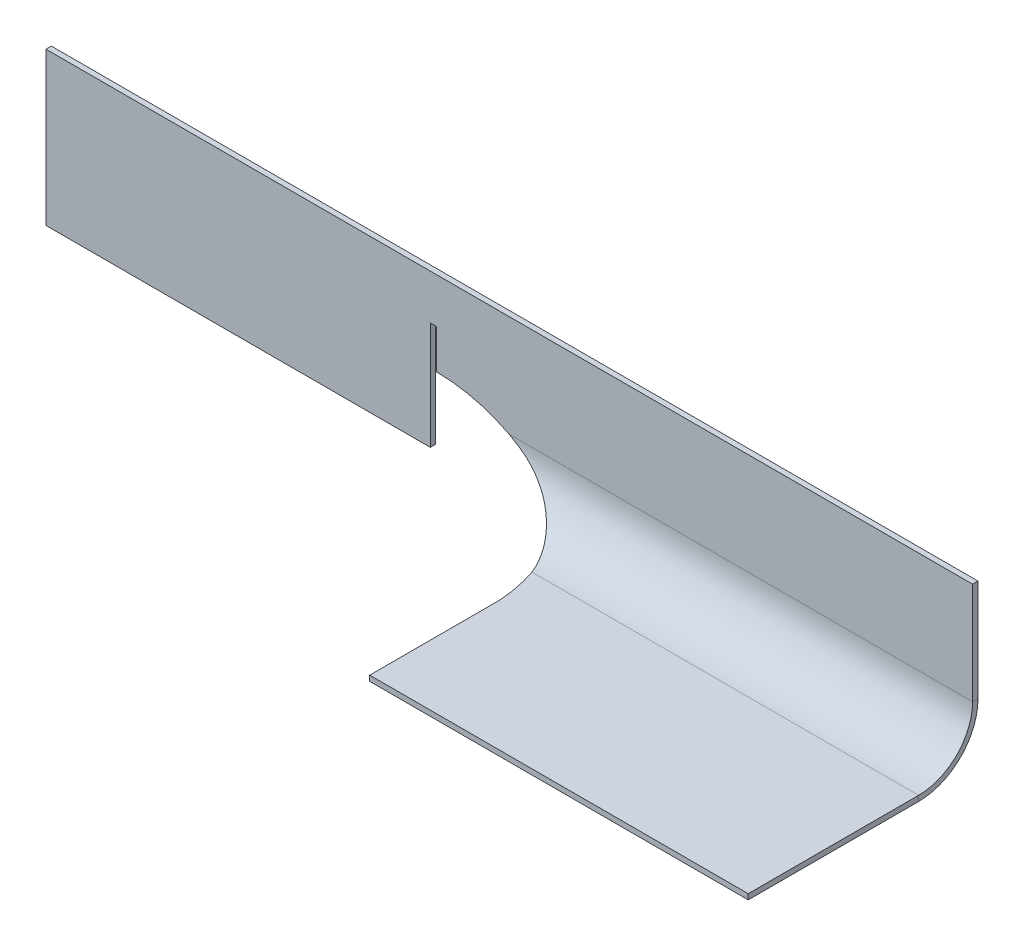
ISO-10303-21;
HEADER;
FILE_DESCRIPTION(('STEP AP214'),'2;1');
FILE_NAME('part.step','',(''),(''),'','','');
FILE_SCHEMA(('AUTOMOTIVE_DESIGN { 1 0 10303 214 1 1 1 1 }'));
ENDSEC;
DATA;
#1=APPLICATION_CONTEXT('core data for automotive mechanical design processes');
#2=APPLICATION_PROTOCOL_DEFINITION('international standard','automotive_design',2000,#1);
#3=PRODUCT_CONTEXT('',#1,'mechanical');
#4=PRODUCT('Part','Part','',(#3));
#5=PRODUCT_RELATED_PRODUCT_CATEGORY('part','',(#4));
#6=PRODUCT_DEFINITION_FORMATION('','',#4);
#7=PRODUCT_DEFINITION_CONTEXT('part definition',#1,'design');
#8=PRODUCT_DEFINITION('design','',#6,#7);
#9=PRODUCT_DEFINITION_SHAPE('','',#8);
#10=(LENGTH_UNIT() NAMED_UNIT(*) SI_UNIT(.MILLI.,.METRE.));
#11=(NAMED_UNIT(*) PLANE_ANGLE_UNIT() SI_UNIT($,.RADIAN.));
#12=(NAMED_UNIT(*) SI_UNIT($,.STERADIAN.) SOLID_ANGLE_UNIT());
#13=UNCERTAINTY_MEASURE_WITH_UNIT(LENGTH_MEASURE(1.E-05),#10,'distance_accuracy_value','');
#14=(GEOMETRIC_REPRESENTATION_CONTEXT(3) GLOBAL_UNCERTAINTY_ASSIGNED_CONTEXT((#13)) GLOBAL_UNIT_ASSIGNED_CONTEXT((#10,
#11,#12)) REPRESENTATION_CONTEXT('',''));
#15=CARTESIAN_POINT('',(0.,0.,0.));
#16=DIRECTION('',(0.,0.,1.));
#17=DIRECTION('',(1.,0.,0.));
#18=AXIS2_PLACEMENT_3D('',#15,#16,#17);
#19=CARTESIAN_POINT('',(72.3649053756987,-28.8652179905853,21.4667213985971));
#20=DIRECTION('',(0.,-1.,0.));
#21=DIRECTION('',(-1.,0.,0.));
#22=AXIS2_PLACEMENT_3D('',#19,#20,#21);
#23=CYLINDRICAL_SURFACE('',#22,29.2213818747976);
#24=CARTESIAN_POINT('',(72.3649053756987,-28.8652179905853,21.4667213985971));
#25=DIRECTION('',(0.,-1.,0.));
#26=DIRECTION('',(-1.,0.,0.));
#27=AXIS2_PLACEMENT_3D('',#24,#25,#26);
#28=CIRCLE('',#27,29.2213818747976);
#29=CARTESIAN_POINT('',(100.010345228125,-28.8652179905853,12.));
#30=VERTEX_POINT('',#29);
#31=CARTESIAN_POINT('',(101.514777341765,-28.8652179905853,19.4236543329572));
#32=VERTEX_POINT('',#31);
#33=EDGE_CURVE('E378',#30,#32,#28,.T.);
#34=ORIENTED_EDGE('',*,*,#33,.F.);
#35=CARTESIAN_POINT('',(100.010345228125,-29.8652179905853,12.));
#36=CARTESIAN_POINT('',(100.010345228125,-28.8652179905853,12.));
#37=B_SPLINE_CURVE_WITH_KNOTS('',1,(#35,#36),.UNSPECIFIED.,.F.,.F.,(2,2),(0.,1.),.UNSPECIFIED.);
#38=CARTESIAN_POINT('',(100.010345228125,-29.8652179905853,12.));
#39=VERTEX_POINT('',#38);
#40=EDGE_CURVE('E12',#30,#39,#37,.F.);
#41=ORIENTED_EDGE('',*,*,#40,.T.);
#42=CARTESIAN_POINT('',(72.3649053756987,-29.8652179905853,21.4667213985971));
#43=DIRECTION('',(0.,-1.,0.));
#44=DIRECTION('',(-1.,0.,0.));
#45=AXIS2_PLACEMENT_3D('',#42,#43,#44);
#46=CIRCLE('',#45,29.2213818747976);
#47=CARTESIAN_POINT('',(101.514777341765,-29.8652179905853,19.4236543329572));
#48=VERTEX_POINT('',#47);
#49=EDGE_CURVE('E65',#39,#48,#46,.T.);
#50=ORIENTED_EDGE('',*,*,#49,.T.);
#51=DIRECTION('',(0.,1.,0.));
#52=VECTOR('',#51,1.);
#53=CARTESIAN_POINT('',(101.514777341765,-28.8652179905853,19.4236543329572));
#54=LINE('',#53,#52);
#55=EDGE_CURVE('E178',#48,#32,#54,.T.);
#56=ORIENTED_EDGE('',*,*,#55,.T.);
#57=EDGE_LOOP('',(#34,#41,#50,#56));
#58=FACE_BOUND('',#57,.T.);
#59=ADVANCED_FACE('F49',(#58),#23,.F.);
#60=CARTESIAN_POINT('',(171.620662180867,-28.8652179905854,-23.3585794219317));
#61=DIRECTION('',(-1.,0.,0.));
#62=DIRECTION('',(0.,0.,-1.));
#63=AXIS2_PLACEMENT_3D('',#60,#61,#62);
#64=PLANE('',#63);
#65=DIRECTION('',(0.,0.,-1.));
#66=VECTOR('',#65,1.);
#67=CARTESIAN_POINT('',(171.620662180867,-29.8652179905853,21.4667213985971));
#68=LINE('',#67,#66);
#69=CARTESIAN_POINT('',(171.620662180867,-29.8652179905852,43.5586281703939));
#70=VERTEX_POINT('',#69);
#71=CARTESIAN_POINT('',(171.620662180867,-29.8652179905853,12.));
#72=VERTEX_POINT('',#71);
#73=EDGE_CURVE('E72',#70,#72,#68,.T.);
#74=ORIENTED_EDGE('',*,*,#73,.T.);
#75=DIRECTION('',(0.,1.,0.));
#76=VECTOR('',#75,1.);
#77=CARTESIAN_POINT('',(171.620662180867,-28.8652179905856,12.));
#78=LINE('',#77,#76);
#79=CARTESIAN_POINT('',(171.620662180867,-28.8652179905853,12.));
#80=VERTEX_POINT('',#79);
#81=EDGE_CURVE('E149',#72,#80,#78,.T.);
#82=ORIENTED_EDGE('',*,*,#81,.T.);
#83=DIRECTION('',(0.,0.,-1.));
#84=VECTOR('',#83,1.);
#85=CARTESIAN_POINT('',(171.620662180867,-28.8652179905854,-23.3585794219317));
#86=LINE('',#85,#84);
#87=CARTESIAN_POINT('',(171.620662180867,-28.8652179905852,43.5586281703939));
#88=VERTEX_POINT('',#87);
#89=EDGE_CURVE('E152',#88,#80,#86,.T.);
#90=ORIENTED_EDGE('',*,*,#89,.F.);
#91=DIRECTION('',(0.,1.,0.));
#92=VECTOR('',#91,1.);
#93=CARTESIAN_POINT('',(171.620662180867,-28.8652179905852,43.5586281703939));
#94=LINE('',#93,#92);
#95=EDGE_CURVE('E167',#70,#88,#94,.T.);
#96=ORIENTED_EDGE('',*,*,#95,.F.);
#97=EDGE_LOOP('',(#74,#82,#90,#96));
#98=FACE_BOUND('',#97,.T.);
#99=ADVANCED_FACE('F151',(#98),#64,.F.);
#100=CARTESIAN_POINT('',(72.3649053756987,-29.8652179905853,21.4667213985971));
#101=DIRECTION('',(0.,-1.,0.));
#102=DIRECTION('',(-1.,0.,0.));
#103=AXIS2_PLACEMENT_3D('',#100,#101,#102);
#104=PLANE('',#103);
#105=ORIENTED_EDGE('',*,*,#49,.F.);
#106=DIRECTION('',(1.,0.,0.));
#107=VECTOR('',#106,1.);
#108=CARTESIAN_POINT('',(72.3649053756987,-29.8652179905853,12.));
#109=LINE('',#108,#107);
#110=EDGE_CURVE('E58',#39,#72,#109,.T.);
#111=ORIENTED_EDGE('',*,*,#110,.T.);
#112=ORIENTED_EDGE('',*,*,#73,.F.);
#113=DIRECTION('',(-1.,0.,0.));
#114=VECTOR('',#113,1.);
#115=CARTESIAN_POINT('',(72.3649053756987,-29.8652179905852,43.558628170394));
#116=LINE('',#115,#114);
#117=CARTESIAN_POINT('',(101.514777341765,-29.8652179905852,43.558628170394));
#118=VERTEX_POINT('',#117);
#119=EDGE_CURVE('E394',#118,#70,#116,.F.);
#120=ORIENTED_EDGE('',*,*,#119,.F.);
#121=DIRECTION('',(0.,0.,-1.));
#122=VECTOR('',#121,1.);
#123=CARTESIAN_POINT('',(101.514777341765,-29.8652179905853,21.4667213985971));
#124=LINE('',#123,#122);
#125=EDGE_CURVE('E392',#48,#118,#124,.F.);
#126=ORIENTED_EDGE('',*,*,#125,.F.);
#127=EDGE_LOOP('',(#105,#111,#112,#120,#126));
#128=FACE_BOUND('',#127,.T.);
#129=ADVANCED_FACE('F365',(#128),#104,.T.);
#130=CARTESIAN_POINT('',(101.514777341765,-28.8652179905853,19.4236543329572));
#131=DIRECTION('',(1.,0.,0.));
#132=DIRECTION('',(0.,0.,1.));
#133=AXIS2_PLACEMENT_3D('',#130,#131,#132);
#134=PLANE('',#133);
#135=ORIENTED_EDGE('',*,*,#55,.F.);
#136=ORIENTED_EDGE('',*,*,#125,.T.);
#137=DIRECTION('',(0.,1.,0.));
#138=VECTOR('',#137,1.);
#139=CARTESIAN_POINT('',(101.514777341765,-28.8652179905852,43.5586281703939));
#140=LINE('',#139,#138);
#141=CARTESIAN_POINT('',(101.514777341765,-28.8652179905852,43.5586281703939));
#142=VERTEX_POINT('',#141);
#143=EDGE_CURVE('E401',#118,#142,#140,.T.);
#144=ORIENTED_EDGE('',*,*,#143,.T.);
#145=DIRECTION('',(0.,0.,1.));
#146=VECTOR('',#145,1.);
#147=CARTESIAN_POINT('',(101.514777341765,-28.8652179905853,19.4236543329572));
#148=LINE('',#147,#146);
#149=EDGE_CURVE('E383',#32,#142,#148,.T.);
#150=ORIENTED_EDGE('',*,*,#149,.F.);
#151=EDGE_LOOP('',(#135,#136,#144,#150));
#152=FACE_BOUND('',#151,.T.);
#153=ADVANCED_FACE('F361',(#152),#134,.F.);
#154=CARTESIAN_POINT('',(171.620662180867,-28.8652179905852,43.5586281703939));
#155=DIRECTION('',(0.,0.,-1.));
#156=DIRECTION('',(1.,0.,0.));
#157=AXIS2_PLACEMENT_3D('',#154,#155,#156);
#158=PLANE('',#157);
#159=ORIENTED_EDGE('',*,*,#143,.F.);
#160=ORIENTED_EDGE('',*,*,#119,.T.);
#161=ORIENTED_EDGE('',*,*,#95,.T.);
#162=DIRECTION('',(1.,0.,0.));
#163=VECTOR('',#162,1.);
#164=CARTESIAN_POINT('',(171.620662180867,-28.8652179905852,43.5586281703939));
#165=LINE('',#164,#163);
#166=EDGE_CURVE('E166',#142,#88,#165,.T.);
#167=ORIENTED_EDGE('',*,*,#166,.F.);
#168=EDGE_LOOP('',(#159,#160,#161,#167));
#169=FACE_BOUND('',#168,.T.);
#170=ADVANCED_FACE('F358',(#169),#158,.F.);
#171=CARTESIAN_POINT('',(72.3649053756987,-28.8652179905853,21.4667213985971));
#172=DIRECTION('',(0.,-1.,0.));
#173=DIRECTION('',(-1.,0.,0.));
#174=AXIS2_PLACEMENT_3D('',#171,#172,#173);
#175=PLANE('',#174);
#176=DIRECTION('',(1.,0.,0.));
#177=VECTOR('',#176,1.);
#178=CARTESIAN_POINT('',(72.3649053756987,-28.8652179905853,12.));
#179=LINE('',#178,#177);
#180=EDGE_CURVE('E157',#30,#80,#179,.T.);
#181=ORIENTED_EDGE('',*,*,#180,.F.);
#182=ORIENTED_EDGE('',*,*,#33,.T.);
#183=ORIENTED_EDGE('',*,*,#149,.T.);
#184=ORIENTED_EDGE('',*,*,#166,.T.);
#185=ORIENTED_EDGE('',*,*,#89,.T.);
#186=EDGE_LOOP('',(#181,#182,#183,#184,#185));
#187=FACE_BOUND('',#186,.T.);
#188=ADVANCED_FACE('F162',(#187),#175,.F.);
#189=CARTESIAN_POINT('',(72.3649053756987,-15.6039189457312,2.));
#190=DIRECTION('',(1.,0.,0.));
#191=DIRECTION('',(0.,-1.,0.));
#192=AXIS2_PLACEMENT_3D('',#189,#190,#191);
#193=PLANE('',#192);
#194=DIRECTION('',(0.,0.,1.));
#195=VECTOR('',#194,1.);
#196=CARTESIAN_POINT('',(72.3649053756987,-8.32253934842878,2.));
#197=LINE('',#196,#195);
#198=CARTESIAN_POINT('',(72.3649053756987,-8.32253934842878,1.));
#199=VERTEX_POINT('',#198);
#200=CARTESIAN_POINT('',(72.3649053756987,-8.32253934842878,2.));
#201=VERTEX_POINT('',#200);
#202=EDGE_CURVE('E321',#199,#201,#197,.T.);
#203=ORIENTED_EDGE('',*,*,#202,.F.);
#204=DIRECTION('',(0.,1.,0.));
#205=VECTOR('',#204,1.);
#206=CARTESIAN_POINT('',(72.3649053756987,-44.8253008205288,1.));
#207=LINE('',#206,#205);
#208=CARTESIAN_POINT('',(72.3649053756987,-15.6039189457312,1.));
#209=VERTEX_POINT('',#208);
#210=EDGE_CURVE('E328',#199,#209,#207,.F.);
#211=ORIENTED_EDGE('',*,*,#210,.T.);
#212=DIRECTION('',(0.,0.,1.));
#213=VECTOR('',#212,1.);
#214=CARTESIAN_POINT('',(72.3649053756987,-15.6039189457312,2.));
#215=LINE('',#214,#213);
#216=CARTESIAN_POINT('',(72.3649053756987,-15.6039189457312,2.));
#217=VERTEX_POINT('',#216);
#218=EDGE_CURVE('E326',#209,#217,#215,.T.);
#219=ORIENTED_EDGE('',*,*,#218,.T.);
#220=DIRECTION('',(0.,-1.,0.));
#221=VECTOR('',#220,1.);
#222=CARTESIAN_POINT('',(72.3649053756987,-15.6039189457312,2.));
#223=LINE('',#222,#221);
#224=EDGE_CURVE('E279',#201,#217,#223,.T.);
#225=ORIENTED_EDGE('',*,*,#224,.F.);
#226=EDGE_LOOP('',(#203,#211,#219,#225));
#227=FACE_BOUND('',#226,.T.);
#228=ADVANCED_FACE('F241',(#227),#193,.F.);
#229=CARTESIAN_POINT('',(72.3649053756987,-8.32253934842878,2.));
#230=DIRECTION('',(0.,1.,0.));
#231=DIRECTION('',(1.,0.,0.));
#232=AXIS2_PLACEMENT_3D('',#229,#230,#231);
#233=PLANE('',#232);
#234=DIRECTION('',(0.,0.,1.));
#235=VECTOR('',#234,1.);
#236=CARTESIAN_POINT('',(71.1731473107281,-8.32253934842878,2.));
#237=LINE('',#236,#235);
#238=CARTESIAN_POINT('',(71.1731473107281,-8.32253934842878,1.));
#239=VERTEX_POINT('',#238);
#240=CARTESIAN_POINT('',(71.1731473107281,-8.32253934842878,2.));
#241=VERTEX_POINT('',#240);
#242=EDGE_CURVE('E316',#239,#241,#237,.T.);
#243=ORIENTED_EDGE('',*,*,#242,.F.);
#244=DIRECTION('',(-1.,0.,0.));
#245=VECTOR('',#244,1.);
#246=CARTESIAN_POINT('',(72.3649053756987,-8.32253934842878,1.));
#247=LINE('',#246,#245);
#248=EDGE_CURVE('E323',#239,#199,#247,.F.);
#249=ORIENTED_EDGE('',*,*,#248,.T.);
#250=ORIENTED_EDGE('',*,*,#202,.T.);
#251=DIRECTION('',(1.,0.,0.));
#252=VECTOR('',#251,1.);
#253=CARTESIAN_POINT('',(72.3649053756987,-8.32253934842878,2.));
#254=LINE('',#253,#252);
#255=EDGE_CURVE('E282',#241,#201,#254,.T.);
#256=ORIENTED_EDGE('',*,*,#255,.F.);
#257=EDGE_LOOP('',(#243,#249,#250,#256));
#258=FACE_BOUND('',#257,.T.);
#259=ADVANCED_FACE('F440',(#258),#233,.F.);
#260=CARTESIAN_POINT('',(71.1731473107281,-8.32253934842878,2.));
#261=DIRECTION('',(-1.,0.,0.));
#262=DIRECTION('',(0.,1.,0.));
#263=AXIS2_PLACEMENT_3D('',#260,#261,#262);
#264=PLANE('',#263);
#265=DIRECTION('',(0.,0.,1.));
#266=VECTOR('',#265,1.);
#267=CARTESIAN_POINT('',(71.1731473107281,-28.2760944950853,2.));
#268=LINE('',#267,#266);
#269=CARTESIAN_POINT('',(71.1731473107281,-28.2760944950853,1.));
#270=VERTEX_POINT('',#269);
#271=CARTESIAN_POINT('',(71.1731473107281,-28.2760944950853,2.));
#272=VERTEX_POINT('',#271);
#273=EDGE_CURVE('E311',#270,#272,#268,.T.);
#274=ORIENTED_EDGE('',*,*,#273,.F.);
#275=DIRECTION('',(0.,1.,0.));
#276=VECTOR('',#275,1.);
#277=CARTESIAN_POINT('',(71.1731473107281,-44.8253008205288,1.));
#278=LINE('',#277,#276);
#279=EDGE_CURVE('E318',#270,#239,#278,.T.);
#280=ORIENTED_EDGE('',*,*,#279,.T.);
#281=ORIENTED_EDGE('',*,*,#242,.T.);
#282=DIRECTION('',(0.,1.,0.));
#283=VECTOR('',#282,1.);
#284=CARTESIAN_POINT('',(71.1731473107281,-8.32253934842878,2.));
#285=LINE('',#284,#283);
#286=EDGE_CURVE('E285',#272,#241,#285,.T.);
#287=ORIENTED_EDGE('',*,*,#286,.F.);
#288=EDGE_LOOP('',(#274,#280,#281,#287));
#289=FACE_BOUND('',#288,.T.);
#290=ADVANCED_FACE('F438',(#289),#264,.F.);
#291=CARTESIAN_POINT('',(71.1731473107281,-28.2760944950853,2.));
#292=DIRECTION('',(0.,1.,0.));
#293=DIRECTION('',(1.,0.,0.));
#294=AXIS2_PLACEMENT_3D('',#291,#292,#293);
#295=PLANE('',#294);
#296=DIRECTION('',(0.,0.,1.));
#297=VECTOR('',#296,1.);
#298=CARTESIAN_POINT('',(0.,-28.2760944950853,2.));
#299=LINE('',#298,#297);
#300=CARTESIAN_POINT('',(0.,-28.2760944950853,1.));
#301=VERTEX_POINT('',#300);
#302=CARTESIAN_POINT('',(0.,-28.2760944950853,2.));
#303=VERTEX_POINT('',#302);
#304=EDGE_CURVE('E306',#301,#303,#299,.T.);
#305=ORIENTED_EDGE('',*,*,#304,.F.);
#306=DIRECTION('',(-1.,0.,0.));
#307=VECTOR('',#306,1.);
#308=CARTESIAN_POINT('',(72.3649053756987,-28.2760944950853,1.));
#309=LINE('',#308,#307);
#310=EDGE_CURVE('E313',#301,#270,#309,.F.);
#311=ORIENTED_EDGE('',*,*,#310,.T.);
#312=ORIENTED_EDGE('',*,*,#273,.T.);
#313=DIRECTION('',(1.,0.,0.));
#314=VECTOR('',#313,1.);
#315=CARTESIAN_POINT('',(71.1731473107281,-28.2760944950853,2.));
#316=LINE('',#315,#314);
#317=EDGE_CURVE('E288',#303,#272,#316,.T.);
#318=ORIENTED_EDGE('',*,*,#317,.F.);
#319=EDGE_LOOP('',(#305,#311,#312,#318));
#320=FACE_BOUND('',#319,.T.);
#321=ADVANCED_FACE('F433',(#320),#295,.F.);
#322=CARTESIAN_POINT('',(0.,-28.2760944950853,2.));
#323=DIRECTION('',(1.,0.,0.));
#324=DIRECTION('',(0.,-1.,0.));
#325=AXIS2_PLACEMENT_3D('',#322,#323,#324);
#326=PLANE('',#325);
#327=DIRECTION('',(0.,1.,0.));
#328=VECTOR('',#327,1.);
#329=CARTESIAN_POINT('',(0.,-44.8253008205288,1.));
#330=LINE('',#329,#328);
#331=CARTESIAN_POINT('',(0.,0.,1.));
#332=VERTEX_POINT('',#331);
#333=EDGE_CURVE('E308',#332,#301,#330,.F.);
#334=ORIENTED_EDGE('',*,*,#333,.T.);
#335=ORIENTED_EDGE('',*,*,#304,.T.);
#336=DIRECTION('',(0.,-1.,0.));
#337=VECTOR('',#336,1.);
#338=CARTESIAN_POINT('',(0.,-28.2760944950853,2.));
#339=LINE('',#338,#337);
#340=CARTESIAN_POINT('',(0.,0.,2.));
#341=VERTEX_POINT('',#340);
#342=EDGE_CURVE('E291',#341,#303,#339,.T.);
#343=ORIENTED_EDGE('',*,*,#342,.F.);
#344=DIRECTION('',(0.,0.,1.));
#345=VECTOR('',#344,1.);
#346=CARTESIAN_POINT('',(0.,0.,2.));
#347=LINE('',#346,#345);
#348=EDGE_CURVE('E300',#332,#341,#347,.T.);
#349=ORIENTED_EDGE('',*,*,#348,.F.);
#350=EDGE_LOOP('',(#334,#335,#343,#349));
#351=FACE_BOUND('',#350,.T.);
#352=ADVANCED_FACE('F427',(#351),#326,.F.);
#353=CARTESIAN_POINT('',(0.,0.,2.));
#354=DIRECTION('',(0.,-1.,0.));
#355=DIRECTION('',(-1.,0.,0.));
#356=AXIS2_PLACEMENT_3D('',#353,#354,#355);
#357=PLANE('',#356);
#358=DIRECTION('',(0.,0.,1.));
#359=VECTOR('',#358,1.);
#360=CARTESIAN_POINT('',(171.620662180867,0.,2.));
#361=LINE('',#360,#359);
#362=CARTESIAN_POINT('',(171.620662180867,0.,1.));
#363=VERTEX_POINT('',#362);
#364=CARTESIAN_POINT('',(171.620662180867,0.,2.));
#365=VERTEX_POINT('',#364);
#366=EDGE_CURVE('E268',#363,#365,#361,.T.);
#367=ORIENTED_EDGE('',*,*,#366,.F.);
#368=DIRECTION('',(-1.,0.,0.));
#369=VECTOR('',#368,1.);
#370=CARTESIAN_POINT('',(72.3649053756987,0.,1.));
#371=LINE('',#370,#369);
#372=EDGE_CURVE('E303',#363,#332,#371,.T.);
#373=ORIENTED_EDGE('',*,*,#372,.T.);
#374=ORIENTED_EDGE('',*,*,#348,.T.);
#375=DIRECTION('',(-1.,0.,0.));
#376=VECTOR('',#375,1.);
#377=CARTESIAN_POINT('',(0.,0.,2.));
#378=LINE('',#377,#376);
#379=EDGE_CURVE('E294',#365,#341,#378,.T.);
#380=ORIENTED_EDGE('',*,*,#379,.F.);
#381=EDGE_LOOP('',(#367,#373,#374,#380));
#382=FACE_BOUND('',#381,.T.);
#383=ADVANCED_FACE('F424',(#382),#357,.F.);
#384=CARTESIAN_POINT('',(72.3649053756987,-44.8253008205288,2.));
#385=DIRECTION('',(0.,0.,-1.));
#386=DIRECTION('',(-1.,0.,0.));
#387=AXIS2_PLACEMENT_3D('',#384,#385,#386);
#388=PLANE('',#387);
#389=CARTESIAN_POINT('',(72.3649053756987,-44.8253008205288,2.));
#390=DIRECTION('',(0.,0.,-1.));
#391=DIRECTION('',(-1.,0.,0.));
#392=AXIS2_PLACEMENT_3D('',#389,#390,#391);
#393=CIRCLE('',#392,29.2213818747976);
#394=CARTESIAN_POINT('',(85.7799438823606,-18.8652179905853,2.));
#395=VERTEX_POINT('',#394);
#396=EDGE_CURVE('E302',#217,#395,#393,.T.);
#397=ORIENTED_EDGE('',*,*,#396,.T.);
#398=DIRECTION('',(1.,0.,0.));
#399=VECTOR('',#398,1.);
#400=CARTESIAN_POINT('',(72.3649053756987,-18.8652179905853,2.));
#401=LINE('',#400,#399);
#402=CARTESIAN_POINT('',(171.620662180867,-18.8652179905853,2.));
#403=VERTEX_POINT('',#402);
#404=EDGE_CURVE('E299',#395,#403,#401,.T.);
#405=ORIENTED_EDGE('',*,*,#404,.T.);
#406=DIRECTION('',(0.,1.,0.));
#407=VECTOR('',#406,1.);
#408=CARTESIAN_POINT('',(171.620662180867,0.,2.));
#409=LINE('',#408,#407);
#410=EDGE_CURVE('E297',#403,#365,#409,.T.);
#411=ORIENTED_EDGE('',*,*,#410,.T.);
#412=ORIENTED_EDGE('',*,*,#379,.T.);
#413=ORIENTED_EDGE('',*,*,#342,.T.);
#414=ORIENTED_EDGE('',*,*,#317,.T.);
#415=ORIENTED_EDGE('',*,*,#286,.T.);
#416=ORIENTED_EDGE('',*,*,#255,.T.);
#417=ORIENTED_EDGE('',*,*,#224,.T.);
#418=EDGE_LOOP('',(#397,#405,#411,#412,#413,#414,#415,#416,#417));
#419=FACE_BOUND('',#418,.T.);
#420=ADVANCED_FACE('F416',(#419),#388,.F.);
#421=CARTESIAN_POINT('',(171.620662180867,0.,2.));
#422=DIRECTION('',(-1.,0.,0.));
#423=DIRECTION('',(0.,1.,0.));
#424=AXIS2_PLACEMENT_3D('',#421,#422,#423);
#425=PLANE('',#424);
#426=DIRECTION('',(0.,0.,1.));
#427=VECTOR('',#426,1.);
#428=CARTESIAN_POINT('',(171.620662180867,-18.8652179905853,1.99999999999987));
#429=LINE('',#428,#427);
#430=CARTESIAN_POINT('',(171.620662180867,-18.8652179905853,1.));
#431=VERTEX_POINT('',#430);
#432=EDGE_CURVE('E183',#431,#403,#429,.T.);
#433=ORIENTED_EDGE('',*,*,#432,.F.);
#434=DIRECTION('',(0.,1.,0.));
#435=VECTOR('',#434,1.);
#436=CARTESIAN_POINT('',(171.620662180867,-44.8253008205288,1.));
#437=LINE('',#436,#435);
#438=EDGE_CURVE('E277',#431,#363,#437,.T.);
#439=ORIENTED_EDGE('',*,*,#438,.T.);
#440=ORIENTED_EDGE('',*,*,#366,.T.);
#441=ORIENTED_EDGE('',*,*,#410,.F.);
#442=EDGE_LOOP('',(#433,#439,#440,#441));
#443=FACE_BOUND('',#442,.T.);
#444=ADVANCED_FACE('F421',(#443),#425,.F.);
#445=CARTESIAN_POINT('',(72.3649053756987,-44.8253008205288,1.));
#446=DIRECTION('',(0.,0.,-1.));
#447=DIRECTION('',(-1.,0.,0.));
#448=AXIS2_PLACEMENT_3D('',#445,#446,#447);
#449=PLANE('',#448);
#450=DIRECTION('',(1.,0.,0.));
#451=VECTOR('',#450,1.);
#452=CARTESIAN_POINT('',(72.3649053756987,-18.8652179905853,1.));
#453=LINE('',#452,#451);
#454=CARTESIAN_POINT('',(85.7799438823606,-18.8652179905853,1.));
#455=VERTEX_POINT('',#454);
#456=EDGE_CURVE('E187',#455,#431,#453,.T.);
#457=ORIENTED_EDGE('',*,*,#456,.F.);
#458=CARTESIAN_POINT('',(72.3649053756987,-44.8253008205288,1.));
#459=DIRECTION('',(0.,0.,-1.));
#460=DIRECTION('',(-1.,0.,0.));
#461=AXIS2_PLACEMENT_3D('',#458,#459,#460);
#462=CIRCLE('',#461,29.2213818747976);
#463=EDGE_CURVE('E276',#209,#455,#462,.T.);
#464=ORIENTED_EDGE('',*,*,#463,.F.);
#465=ORIENTED_EDGE('',*,*,#210,.F.);
#466=ORIENTED_EDGE('',*,*,#248,.F.);
#467=ORIENTED_EDGE('',*,*,#279,.F.);
#468=ORIENTED_EDGE('',*,*,#310,.F.);
#469=ORIENTED_EDGE('',*,*,#333,.F.);
#470=ORIENTED_EDGE('',*,*,#372,.F.);
#471=ORIENTED_EDGE('',*,*,#438,.F.);
#472=EDGE_LOOP('',(#457,#464,#465,#466,#467,#468,#469,#470,#471));
#473=FACE_BOUND('',#472,.T.);
#474=ADVANCED_FACE('F356',(#473),#449,.T.);
#475=CARTESIAN_POINT('',(72.3649053756987,-44.8253008205288,2.));
#476=DIRECTION('',(0.,0.,-1.));
#477=DIRECTION('',(-1.,0.,0.));
#478=AXIS2_PLACEMENT_3D('',#475,#476,#477);
#479=CYLINDRICAL_SURFACE('',#478,29.2213818747976);
#480=CARTESIAN_POINT('',(85.7799438823606,-18.8652179905853,2.));
#481=CARTESIAN_POINT('',(85.7799438823606,-18.8652179905853,1.));
#482=B_SPLINE_CURVE_WITH_KNOTS('',1,(#480,#481),.UNSPECIFIED.,.F.,.F.,(2,2),(0.,1.),.UNSPECIFIED.);
#483=EDGE_CURVE('E184',#395,#455,#482,.T.);
#484=ORIENTED_EDGE('',*,*,#483,.F.);
#485=ORIENTED_EDGE('',*,*,#396,.F.);
#486=ORIENTED_EDGE('',*,*,#218,.F.);
#487=ORIENTED_EDGE('',*,*,#463,.T.);
#488=EDGE_LOOP('',(#484,#485,#486,#487));
#489=FACE_BOUND('',#488,.T.);
#490=ADVANCED_FACE('F240',(#489),#479,.F.);
#491=CARTESIAN_POINT('',(85.7799438823606,-18.8652179905853,1.));
#492=CARTESIAN_POINT('',(86.7753498453166,-19.4498049144123,1.));
#493=CARTESIAN_POINT('',(87.6582544967979,-20.0005708552323,1.04650259355788));
#494=CARTESIAN_POINT('',(88.8141335148364,-20.768532953941,1.16282209058487));
#495=CARTESIAN_POINT('',(89.171331638317,-21.01488501844,1.20937427264309));
#496=CARTESIAN_POINT('',(89.6649864997398,-21.3695680915363,1.28818882954416));
#497=CARTESIAN_POINT('',(89.822514399581,-21.4853250511905,1.31595984459191));
#498=CARTESIAN_POINT('',(90.0482706683932,-21.6552338102354,1.35954744905305));
#499=CARTESIAN_POINT('',(90.121766827839,-21.7112491336072,1.3743986221086));
#500=CARTESIAN_POINT('',(90.2293771717703,-21.7943397282994,1.39711971571521));
#501=CARTESIAN_POINT('',(90.2648083038745,-21.8218812053395,1.40476747735664));
#502=CARTESIAN_POINT('',(90.3172965282215,-21.8629603070969,1.41634546116579));
#503=CARTESIAN_POINT('',(90.334682857369,-21.8766144893449,1.42022251317483));
#504=CARTESIAN_POINT('',(90.3605977326378,-21.8970374868,1.42606408766154));
#505=CARTESIAN_POINT('',(90.3692085879853,-21.903835440004,1.42801561193505));
#506=CARTESIAN_POINT('',(90.3820837163936,-21.9140178014306,1.43094932410012));
#507=CARTESIAN_POINT('',(90.3863685667608,-21.9174094938453,1.43192829911631));
#508=CARTESIAN_POINT('',(90.3927855536584,-21.9224933904653,1.43339835892415));
#509=CARTESIAN_POINT('',(90.3949228345153,-21.9241874156717,1.43388864507415));
#510=CARTESIAN_POINT('',(90.3991939666782,-21.9275742521007,1.43486974827742));
#511=CARTESIAN_POINT('',(90.4005929515405,-21.9286838248235,1.43519130811434));
#512=CARTESIAN_POINT('',(91.1374127158528,-22.5134726088643,1.60489842066649));
#513=CARTESIAN_POINT('',(91.8391266818983,-23.111887764353,1.83083670542593));
#514=CARTESIAN_POINT('',(92.8433394380269,-24.0112633762028,2.27221821487798));
#515=CARTESIAN_POINT('',(93.1700173245799,-24.3112672240732,2.43639458663029));
#516=CARTESIAN_POINT('',(93.6479446061746,-24.758093807069,2.70997767491628));
#517=CARTESIAN_POINT('',(93.8052387753336,-24.9065009695564,2.80572166163697));
#518=CARTESIAN_POINT('',(94.0381576420135,-25.1278258853429,2.95634443903658));
#519=CARTESIAN_POINT('',(94.1152935330637,-25.2013862343625,3.00771955825994));
#520=CARTESIAN_POINT('',(94.2302417728743,-25.3113415753804,3.08655371819423));
#521=CARTESIAN_POINT('',(94.268431920017,-25.3479291390692,3.11312699946441));
#522=CARTESIAN_POINT('',(94.32552824154,-25.4027060785873,3.1534321124058));
#523=CARTESIAN_POINT('',(94.3445288655158,-25.4209476562146,3.16694134731955));
#524=CARTESIAN_POINT('',(94.3824671470703,-25.4573946457393,3.19410858812422));
#525=CARTESIAN_POINT('',(94.4018335215369,-25.4760124584247,3.2080779942262));
#526=CARTESIAN_POINT('',(95.0115896187825,-26.0625624705165,3.65097674561948));
#527=CARTESIAN_POINT('',(95.5715076454536,-26.6168417881042,4.15649726995874));
#528=CARTESIAN_POINT('',(96.6286224726315,-27.6459165198179,5.32860285148911));
#529=CARTESIAN_POINT('',(97.1258192731383,-28.1206001904764,5.99538686410203));
#530=CARTESIAN_POINT('',(98.0574916479875,-28.9307904038967,7.48317251046225));
#531=CARTESIAN_POINT('',(98.49196722233,-29.2660834873827,8.3043579999124));
#532=CARTESIAN_POINT('',(99.2981971448505,-29.7334602347618,10.0720260901195));
#533=CARTESIAN_POINT('',(99.6698143361993,-29.8652179905853,11.0182333528026));
#534=CARTESIAN_POINT('',(100.010345228125,-29.8652179905853,12.));
#535=CARTESIAN_POINT('',(85.7799438823606,-18.8652179905853,2.));
#536=CARTESIAN_POINT('',(86.775341621629,-19.3966562580209,2.));
#537=CARTESIAN_POINT('',(87.6582544967979,-19.8973569584462,2.04227508505262));
#538=CARTESIAN_POINT('',(88.8141335148364,-20.5955043209087,2.14802008234988));
#539=CARTESIAN_POINT('',(89.171331638317,-20.8194607431805,2.19034024785735));
#540=CARTESIAN_POINT('',(89.6649864997398,-21.1418999005407,2.26198984504015));
#541=CARTESIAN_POINT('',(89.822514399581,-21.2471335002264,2.28723622235628));
#542=CARTESIAN_POINT('',(90.0482706683932,-21.4015960084491,2.32686131732096));
#543=CARTESIAN_POINT('',(90.121766827839,-21.4525190296961,2.34036238373509));
#544=CARTESIAN_POINT('',(90.2293771717703,-21.5280559339618,2.36101792337747));
#545=CARTESIAN_POINT('',(90.2648083038745,-21.5530936403619,2.36797043396058));
#546=CARTESIAN_POINT('',(90.3172965282215,-21.5904382783231,2.37849587378708));
#547=CARTESIAN_POINT('',(90.334682857369,-21.6028511712759,2.38202046652257));
#548=CARTESIAN_POINT('',(90.3605977326378,-21.6214175325987,2.38733098878322));
#549=CARTESIAN_POINT('',(90.3692085879853,-21.6275974900568,2.38910510175914));
#550=CARTESIAN_POINT('',(90.3820837163936,-21.6368541822629,2.39177211281829));
#551=CARTESIAN_POINT('',(90.3863685667608,-21.6399375390035,2.39266209010574));
#552=CARTESIAN_POINT('',(90.3927855536584,-21.6445592632034,2.39399850811287));
#553=CARTESIAN_POINT('',(90.3949228345153,-21.6460992861184,2.39444422279468));
#554=CARTESIAN_POINT('',(90.3991939666782,-21.6491782283266,2.39533613479766));
#555=CARTESIAN_POINT('',(90.4005929515405,-21.6501869308018,2.39562846192213));
#556=CARTESIAN_POINT('',(91.1374127158528,-22.1818130981117,2.54990765515135));
#557=CARTESIAN_POINT('',(91.8391266818983,-22.7258268758287,2.75530609584175));
#558=CARTESIAN_POINT('',(92.8433394380269,-23.5434410684194,3.15656201352544));
#559=CARTESIAN_POINT('',(93.1700173245799,-23.8161718392106,3.30581326057299));
#560=CARTESIAN_POINT('',(93.6479446061746,-24.2223778237523,3.5545251590148));
#561=CARTESIAN_POINT('',(93.8052387753336,-24.3572934260136,3.6415651469427));
#562=CARTESIAN_POINT('',(94.0381576420135,-24.5584978949104,3.77849494457871));
#563=CARTESIAN_POINT('',(94.1152935330637,-24.6253709394737,3.82519959841813));
#564=CARTESIAN_POINT('',(94.2302417728743,-24.725330340399,3.89686701654021));
#565=CARTESIAN_POINT('',(94.268431920017,-24.7585917619343,3.92102454496765));
#566=CARTESIAN_POINT('',(94.32552824154,-24.8083889796781,3.95766555673254));
#567=CARTESIAN_POINT('',(94.3445288655158,-24.8249722320665,3.96994667938141));
#568=CARTESIAN_POINT('',(94.3824671470703,-24.8581058589071,3.99464417102202));
#569=CARTESIAN_POINT('',(94.4018335215369,-24.8750311431666,4.00734363111473));
#570=CARTESIAN_POINT('',(95.0115896187825,-25.4082584268864,4.40997885965407));
#571=CARTESIAN_POINT('',(95.5715076454536,-25.9121487156025,4.86954297268976));
#572=CARTESIAN_POINT('',(96.6286224726315,-26.8476711989786,5.93509350135374));
#573=CARTESIAN_POINT('',(97.1258192731383,-27.2792018086681,6.5412607855473));
#574=CARTESIAN_POINT('',(98.0574916479875,-28.0157383663229,7.89379319132932));
#575=CARTESIAN_POINT('',(98.49196722233,-28.3205502604011,8.64032545446582));
#576=CARTESIAN_POINT('',(99.2981971448505,-28.7454382125639,10.2472964455631));
#577=CARTESIAN_POINT('',(99.6698173610944,-28.8652179905853,11.1074927942891));
#578=CARTESIAN_POINT('',(100.010345228125,-28.8652179905853,12.));
#579=B_SPLINE_SURFACE_WITH_KNOTS('',1,3,((#491,#492,#493,#494,#495,#496,#497,#498,#499,#500,
#501,#502,#503,#504,#505,#506,#507,#508,#509,#510,#511,#512,#513,#514,#515,#516,#517,#518,#519,
#520,#521,#522,#523,#524,#525,#526,#527,#528,#529,#530,#531,#532,#533,#534),(#535,#536,#537,
#538,#539,#540,#541,#542,#543,#544,#545,#546,#547,#548,#549,#550,#551,#552,#553,#554,#555,#556,
#557,#558,#559,#560,#561,#562,#563,#564,#565,#566,#567,#568,#569,#570,#571,#572,#573,#574,#575,
#576,#577,#578)),.UNSPECIFIED.,.F.,.F.,.F.,(2,2),(4,2,2,2,2,2,2,2,2,2,2,2,2,2,2,2,2,2,2,2,2,4),
(0.,1.),(0.,0.125,0.1875,0.21875,0.234375,0.2421875,0.24609375,0.248046875,0.2490234375,
0.24951171875,0.25,0.375,0.4375,0.46875,0.484375,0.4921875,0.49609375,0.5,0.625,0.75,0.875,1.),.UNSPECIFIED.);
#580=CARTESIAN_POINT('',(85.7799438823606,-18.8652179905853,1.));
#581=CARTESIAN_POINT('',(86.7753498453166,-19.4498049144123,1.));
#582=CARTESIAN_POINT('',(87.6582544967979,-20.0005708552323,1.04650259355788));
#583=CARTESIAN_POINT('',(88.8141335148364,-20.768532953941,1.16282209058487));
#584=CARTESIAN_POINT('',(89.171331638317,-21.01488501844,1.20937427264309));
#585=CARTESIAN_POINT('',(89.6649864997398,-21.3695680915363,1.28818882954416));
#586=CARTESIAN_POINT('',(89.822514399581,-21.4853250511905,1.31595984459191));
#587=CARTESIAN_POINT('',(90.0482706683932,-21.6552338102354,1.35954744905305));
#588=CARTESIAN_POINT('',(90.121766827839,-21.7112491336072,1.3743986221086));
#589=CARTESIAN_POINT('',(90.2293771717703,-21.7943397282994,1.39711971571521));
#590=CARTESIAN_POINT('',(90.2648083038745,-21.8218812053395,1.40476747735664));
#591=CARTESIAN_POINT('',(90.3172965282215,-21.8629603070969,1.41634546116579));
#592=CARTESIAN_POINT('',(90.334682857369,-21.8766144893449,1.42022251317483));
#593=CARTESIAN_POINT('',(90.3605977326378,-21.8970374868,1.42606408766154));
#594=CARTESIAN_POINT('',(90.3692085879853,-21.903835440004,1.42801561193505));
#595=CARTESIAN_POINT('',(90.3820837163936,-21.9140178014306,1.43094932410012));
#596=CARTESIAN_POINT('',(90.3863685667608,-21.9174094938453,1.43192829911631));
#597=CARTESIAN_POINT('',(90.3927855536584,-21.9224933904653,1.43339835892415));
#598=CARTESIAN_POINT('',(90.3949228345153,-21.9241874156717,1.43388864507415));
#599=CARTESIAN_POINT('',(90.3991939666782,-21.9275742521007,1.43486974827742));
#600=CARTESIAN_POINT('',(90.4005929515405,-21.9286838248235,1.43519130811434));
#601=CARTESIAN_POINT('',(91.1374127158528,-22.5134726088643,1.60489842066649));
#602=CARTESIAN_POINT('',(91.8391266818983,-23.111887764353,1.83083670542593));
#603=CARTESIAN_POINT('',(92.8433394380269,-24.0112633762028,2.27221821487798));
#604=CARTESIAN_POINT('',(93.1700173245799,-24.3112672240732,2.43639458663029));
#605=CARTESIAN_POINT('',(93.6479446061746,-24.758093807069,2.70997767491628));
#606=CARTESIAN_POINT('',(93.8052387753336,-24.9065009695564,2.80572166163697));
#607=CARTESIAN_POINT('',(94.0381576420135,-25.1278258853429,2.95634443903658));
#608=CARTESIAN_POINT('',(94.1152935330637,-25.2013862343625,3.00771955825994));
#609=CARTESIAN_POINT('',(94.2302417728743,-25.3113415753804,3.08655371819423));
#610=CARTESIAN_POINT('',(94.268431920017,-25.3479291390692,3.11312699946441));
#611=CARTESIAN_POINT('',(94.32552824154,-25.4027060785873,3.1534321124058));
#612=CARTESIAN_POINT('',(94.3445288655158,-25.4209476562146,3.16694134731955));
#613=CARTESIAN_POINT('',(94.3824671470703,-25.4573946457393,3.19410858812422));
#614=CARTESIAN_POINT('',(94.4018335215369,-25.4760124584247,3.2080779942262));
#615=CARTESIAN_POINT('',(95.0115896187825,-26.0625624705165,3.65097674561948));
#616=CARTESIAN_POINT('',(95.5715076454536,-26.6168417881042,4.15649726995874));
#617=CARTESIAN_POINT('',(96.6286224726315,-27.6459165198179,5.32860285148911));
#618=CARTESIAN_POINT('',(97.1258192731383,-28.1206001904764,5.99538686410203));
#619=CARTESIAN_POINT('',(98.0574916479875,-28.9307904038967,7.48317251046225));
#620=CARTESIAN_POINT('',(98.49196722233,-29.2660834873827,8.3043579999124));
#621=CARTESIAN_POINT('',(99.2981971448505,-29.7334602347618,10.0720260901195));
#622=CARTESIAN_POINT('',(99.6698143361993,-29.8652179905853,11.0182333528026));
#623=CARTESIAN_POINT('',(100.010345228125,-29.8652179905853,12.));
#624=B_SPLINE_CURVE_WITH_KNOTS('',3,(#580,#581,#582,#583,#584,#585,#586,#587,#588,#589,#590,
#591,#592,#593,#594,#595,#596,#597,#598,#599,#600,#601,#602,#603,#604,#605,#606,#607,#608,#609,
#610,#611,#612,#613,#614,#615,#616,#617,#618,#619,#620,#621,#622,#623),.UNSPECIFIED.,.F.,.F.,(4,
2,2,2,2,2,2,2,2,2,2,2,2,2,2,2,2,2,2,2,2,4),(0.,0.125,0.1875,0.21875,0.234375,0.2421875,
0.24609375,0.248046875,0.2490234375,0.24951171875,0.25,0.375,0.4375,0.46875,0.484375,0.4921875,
0.49609375,0.5,0.625,0.75,0.875,1.),.UNSPECIFIED.);
#625=EDGE_CURVE('E192',#455,#39,#624,.T.);
#626=CARTESIAN_POINT('',(100.010345228125,-28.8652179905853,12.));
#627=CARTESIAN_POINT('',(99.6698173610944,-28.8652179905853,11.1074927942891));
#628=CARTESIAN_POINT('',(99.2981971448505,-28.7454382125639,10.2472964455631));
#629=CARTESIAN_POINT('',(98.49196722233,-28.3205502604011,8.64032545446582));
#630=CARTESIAN_POINT('',(98.0574916479875,-28.0157383663229,7.89379319132932));
#631=CARTESIAN_POINT('',(97.1258192731383,-27.2792018086681,6.5412607855473));
#632=CARTESIAN_POINT('',(96.6286224726315,-26.8476711989786,5.93509350135374));
#633=CARTESIAN_POINT('',(95.5715076454536,-25.9121487156025,4.86954297268976));
#634=CARTESIAN_POINT('',(95.0115896187825,-25.4082584268864,4.40997885965407));
#635=CARTESIAN_POINT('',(94.4018335215369,-24.8750311431666,4.00734363111473));
#636=CARTESIAN_POINT('',(94.3824671470703,-24.8581058589071,3.99464417102202));
#637=CARTESIAN_POINT('',(94.3445288655158,-24.8249722320665,3.96994667938141));
#638=CARTESIAN_POINT('',(94.32552824154,-24.8083889796781,3.95766555673254));
#639=CARTESIAN_POINT('',(94.268431920017,-24.7585917619343,3.92102454496765));
#640=CARTESIAN_POINT('',(94.2302417728743,-24.725330340399,3.89686701654021));
#641=CARTESIAN_POINT('',(94.1152935330637,-24.6253709394737,3.82519959841813));
#642=CARTESIAN_POINT('',(94.0381576420135,-24.5584978949104,3.77849494457871));
#643=CARTESIAN_POINT('',(93.8052387753336,-24.3572934260136,3.6415651469427));
#644=CARTESIAN_POINT('',(93.6479446061746,-24.2223778237523,3.5545251590148));
#645=CARTESIAN_POINT('',(93.1700173245799,-23.8161718392106,3.30581326057299));
#646=CARTESIAN_POINT('',(92.8433394380269,-23.5434410684194,3.15656201352544));
#647=CARTESIAN_POINT('',(91.8391266818983,-22.7258268758287,2.75530609584175));
#648=CARTESIAN_POINT('',(91.1374127158528,-22.1818130981117,2.54990765515135));
#649=CARTESIAN_POINT('',(90.4005929515405,-21.6501869308018,2.39562846192213));
#650=CARTESIAN_POINT('',(90.3991939666782,-21.6491782283266,2.39533613479766));
#651=CARTESIAN_POINT('',(90.3949228345153,-21.6460992861184,2.39444422279468));
#652=CARTESIAN_POINT('',(90.3927855536584,-21.6445592632034,2.39399850811287));
#653=CARTESIAN_POINT('',(90.3863685667608,-21.6399375390035,2.39266209010574));
#654=CARTESIAN_POINT('',(90.3820837163936,-21.6368541822629,2.39177211281829));
#655=CARTESIAN_POINT('',(90.3692085879853,-21.6275974900568,2.38910510175914));
#656=CARTESIAN_POINT('',(90.3605977326378,-21.6214175325987,2.38733098878322));
#657=CARTESIAN_POINT('',(90.334682857369,-21.6028511712759,2.38202046652257));
#658=CARTESIAN_POINT('',(90.3172965282215,-21.5904382783231,2.37849587378708));
#659=CARTESIAN_POINT('',(90.2648083038745,-21.5530936403619,2.36797043396058));
#660=CARTESIAN_POINT('',(90.2293771717703,-21.5280559339618,2.36101792337747));
#661=CARTESIAN_POINT('',(90.121766827839,-21.4525190296961,2.34036238373509));
#662=CARTESIAN_POINT('',(90.0482706683932,-21.4015960084491,2.32686131732096));
#663=CARTESIAN_POINT('',(89.822514399581,-21.2471335002264,2.28723622235628));
#664=CARTESIAN_POINT('',(89.6649864997398,-21.1418999005407,2.26198984504015));
#665=CARTESIAN_POINT('',(89.171331638317,-20.8194607431805,2.19034024785735));
#666=CARTESIAN_POINT('',(88.8141335148364,-20.5955043209087,2.14802008234988));
#667=CARTESIAN_POINT('',(87.6582544967979,-19.8973569584462,2.04227508505262));
#668=CARTESIAN_POINT('',(86.775341621629,-19.3966562580209,2.));
#669=CARTESIAN_POINT('',(85.7799438823606,-18.8652179905853,2.));
#670=B_SPLINE_CURVE_WITH_KNOTS('',3,(#626,#627,#628,#629,#630,#631,#632,#633,#634,#635,#636,
#637,#638,#639,#640,#641,#642,#643,#644,#645,#646,#647,#648,#649,#650,#651,#652,#653,#654,#655,
#656,#657,#658,#659,#660,#661,#662,#663,#664,#665,#666,#667,#668,#669),.UNSPECIFIED.,.F.,.F.,(4,
2,2,2,2,2,2,2,2,2,2,2,2,2,2,2,2,2,2,2,2,4),(0.,0.125,0.25,0.375,0.5,0.50390625,0.5078125,
0.515625,0.53125,0.5625,0.625,0.75,0.75048828125,0.7509765625,0.751953125,0.75390625,0.7578125,
0.765625,0.78125,0.8125,0.875,1.),.UNSPECIFIED.);
#671=EDGE_CURVE('E176',#395,#30,#670,.F.);
#672=ORIENTED_EDGE('',*,*,#483,.T.);
#673=ORIENTED_EDGE('',*,*,#625,.T.);
#674=ORIENTED_EDGE('',*,*,#40,.F.);
#675=ORIENTED_EDGE('',*,*,#671,.F.);
#676=EDGE_LOOP('',(#672,#673,#674,#675));
#677=FACE_BOUND('',#676,.T.);
#678=ADVANCED_FACE('F229',(#677),#579,.F.);
#679=CARTESIAN_POINT('',(171.620662180867,-18.8652179905853,12.));
#680=DIRECTION('',(-1.,0.,0.));
#681=DIRECTION('',(0.,0.,1.));
#682=AXIS2_PLACEMENT_3D('',#679,#680,#681);
#683=PLANE('',#682);
#684=ORIENTED_EDGE('',*,*,#81,.F.);
#685=CARTESIAN_POINT('',(171.620662180867,-18.8652179905853,12.));
#686=DIRECTION('',(1.,0.,0.));
#687=DIRECTION('',(0.,0.,-1.));
#688=AXIS2_PLACEMENT_3D('',#685,#686,#687);
#689=CIRCLE('',#688,11.);
#690=EDGE_CURVE('E189',#72,#431,#689,.T.);
#691=ORIENTED_EDGE('',*,*,#690,.T.);
#692=ORIENTED_EDGE('',*,*,#432,.T.);
#693=CARTESIAN_POINT('',(171.620662180867,-18.8652179905853,12.));
#694=DIRECTION('',(1.,0.,0.));
#695=DIRECTION('',(0.,0.,-1.));
#696=AXIS2_PLACEMENT_3D('',#693,#694,#695);
#697=CIRCLE('',#696,10.);
#698=EDGE_CURVE('E174',#80,#403,#697,.T.);
#699=ORIENTED_EDGE('',*,*,#698,.F.);
#700=EDGE_LOOP('',(#684,#691,#692,#699));
#701=FACE_BOUND('',#700,.T.);
#702=ADVANCED_FACE('F181',(#701),#683,.F.);
#703=CARTESIAN_POINT('',(41.2837148500302,-18.8652179905853,12.));
#704=DIRECTION('',(1.,0.,0.));
#705=DIRECTION('',(0.,0.,-1.));
#706=AXIS2_PLACEMENT_3D('',#703,#704,#705);
#707=CYLINDRICAL_SURFACE('',#706,10.);
#708=ORIENTED_EDGE('',*,*,#698,.T.);
#709=ORIENTED_EDGE('',*,*,#404,.F.);
#710=ORIENTED_EDGE('',*,*,#671,.T.);
#711=ORIENTED_EDGE('',*,*,#180,.T.);
#712=EDGE_LOOP('',(#708,#709,#710,#711));
#713=FACE_BOUND('',#712,.T.);
#714=ADVANCED_FACE('F172',(#713),#707,.F.);
#715=CARTESIAN_POINT('',(41.2837148500302,-18.8652179905853,12.));
#716=DIRECTION('',(1.,0.,0.));
#717=DIRECTION('',(0.,0.,-1.));
#718=AXIS2_PLACEMENT_3D('',#715,#716,#717);
#719=CYLINDRICAL_SURFACE('',#718,11.);
#720=ORIENTED_EDGE('',*,*,#690,.F.);
#721=ORIENTED_EDGE('',*,*,#110,.F.);
#722=ORIENTED_EDGE('',*,*,#625,.F.);
#723=ORIENTED_EDGE('',*,*,#456,.T.);
#724=EDGE_LOOP('',(#720,#721,#722,#723));
#725=FACE_BOUND('',#724,.T.);
#726=ADVANCED_FACE('F205',(#725),#719,.T.);
#727=CLOSED_SHELL('',(#59,#99,#129,#153,#170,#188,#228,#259,#290,#321,#352,#383,#420,#444,#474,
#490,#678,#702,#714,#726));
#728=MANIFOLD_SOLID_BREP('B2',#727);
#729=ADVANCED_BREP_SHAPE_REPRESENTATION('',(#18,#728),#14);
#730=SHAPE_DEFINITION_REPRESENTATION(#9,#729);
ENDSEC;
END-ISO-10303-21;
